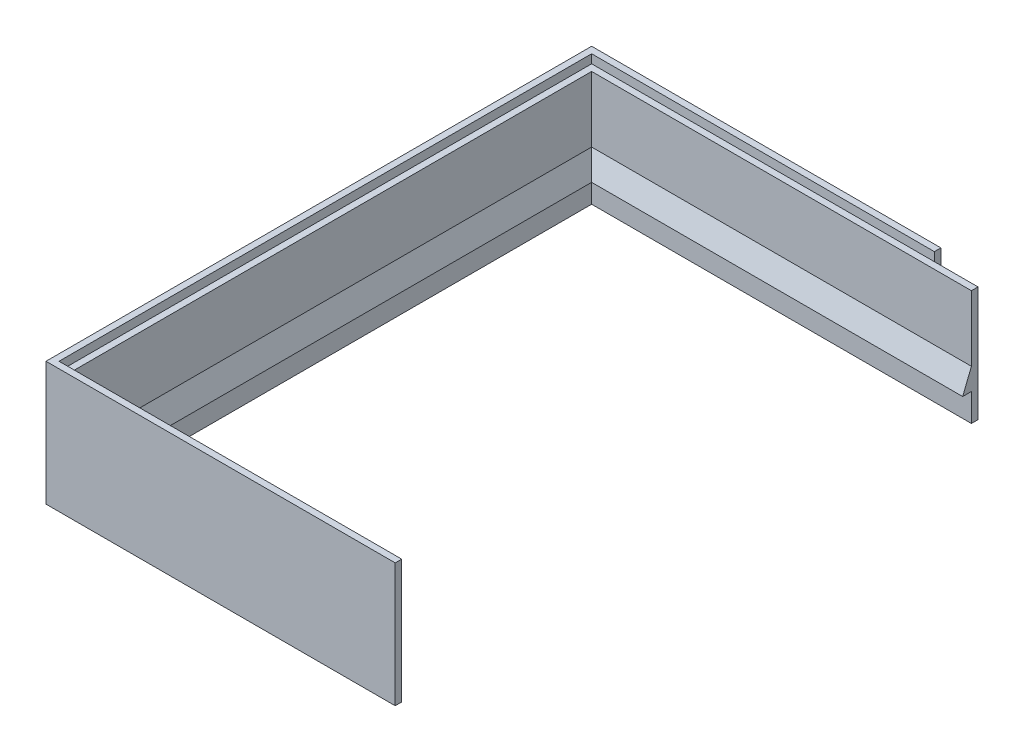
ISO-10303-21;
HEADER;
FILE_DESCRIPTION(('STEP AP214'),'2;1');
FILE_NAME('part.step','',(''),(''),'','','');
FILE_SCHEMA(('AUTOMOTIVE_DESIGN { 1 0 10303 214 1 1 1 1 }'));
ENDSEC;
DATA;
#1=APPLICATION_CONTEXT('core data for automotive mechanical design processes');
#2=APPLICATION_PROTOCOL_DEFINITION('international standard','automotive_design',2000,#1);
#3=PRODUCT_CONTEXT('',#1,'mechanical');
#4=PRODUCT('Part','Part','',(#3));
#5=PRODUCT_RELATED_PRODUCT_CATEGORY('part','',(#4));
#6=PRODUCT_DEFINITION_FORMATION('','',#4);
#7=PRODUCT_DEFINITION_CONTEXT('part definition',#1,'design');
#8=PRODUCT_DEFINITION('design','',#6,#7);
#9=PRODUCT_DEFINITION_SHAPE('','',#8);
#10=(LENGTH_UNIT() NAMED_UNIT(*) SI_UNIT(.MILLI.,.METRE.));
#11=(NAMED_UNIT(*) PLANE_ANGLE_UNIT() SI_UNIT($,.RADIAN.));
#12=(NAMED_UNIT(*) SI_UNIT($,.STERADIAN.) SOLID_ANGLE_UNIT());
#13=UNCERTAINTY_MEASURE_WITH_UNIT(LENGTH_MEASURE(1.E-05),#10,'distance_accuracy_value','');
#14=(GEOMETRIC_REPRESENTATION_CONTEXT(3) GLOBAL_UNCERTAINTY_ASSIGNED_CONTEXT((#13)) GLOBAL_UNIT_ASSIGNED_CONTEXT((#10,
#11,#12)) REPRESENTATION_CONTEXT('',''));
#15=CARTESIAN_POINT('',(0.,0.,0.));
#16=DIRECTION('',(0.,0.,1.));
#17=DIRECTION('',(1.,0.,0.));
#18=AXIS2_PLACEMENT_3D('',#15,#16,#17);
#19=CARTESIAN_POINT('',(0.,22.,-88.51));
#20=DIRECTION('',(-1.,0.,0.));
#21=DIRECTION('',(0.,0.,1.));
#22=AXIS2_PLACEMENT_3D('',#19,#20,#21);
#23=PLANE('',#22);
#24=DIRECTION('',(0.,0.,1.));
#25=VECTOR('',#24,1.);
#26=CARTESIAN_POINT('',(0.,-6.35,0.));
#27=LINE('',#26,#25);
#28=CARTESIAN_POINT('',(0.,-6.35,-90.));
#29=VERTEX_POINT('',#28);
#30=CARTESIAN_POINT('',(0.,-6.35,-88.51));
#31=VERTEX_POINT('',#30);
#32=EDGE_CURVE('E301',#29,#31,#27,.T.);
#33=ORIENTED_EDGE('',*,*,#32,.F.);
#34=DIRECTION('',(0.,-1.,0.));
#35=VECTOR('',#34,1.);
#36=CARTESIAN_POINT('',(0.,-6.35,-90.));
#37=LINE('',#36,#35);
#38=CARTESIAN_POINT('',(0.,22.,-90.));
#39=VERTEX_POINT('',#38);
#40=EDGE_CURVE('E297',#39,#29,#37,.T.);
#41=ORIENTED_EDGE('',*,*,#40,.F.);
#42=DIRECTION('',(0.,0.,1.));
#43=VECTOR('',#42,1.);
#44=CARTESIAN_POINT('',(0.,22.,0.));
#45=LINE('',#44,#43);
#46=CARTESIAN_POINT('',(0.,22.,-88.51));
#47=VERTEX_POINT('',#46);
#48=EDGE_CURVE('E325',#39,#47,#45,.T.);
#49=ORIENTED_EDGE('',*,*,#48,.T.);
#50=DIRECTION('',(0.,-1.,0.));
#51=VECTOR('',#50,1.);
#52=CARTESIAN_POINT('',(0.,22.,-88.51));
#53=LINE('',#52,#51);
#54=CARTESIAN_POINT('',(0.,20.,-88.51));
#55=VERTEX_POINT('',#54);
#56=EDGE_CURVE('E323',#47,#55,#53,.T.);
#57=ORIENTED_EDGE('',*,*,#56,.T.);
#58=DIRECTION('',(0.,-1.,0.));
#59=VECTOR('',#58,1.);
#60=CARTESIAN_POINT('',(0.,22.,-88.51));
#61=LINE('',#60,#59);
#62=EDGE_CURVE('E11',#55,#31,#61,.T.);
#63=ORIENTED_EDGE('',*,*,#62,.T.);
#64=EDGE_LOOP('',(#33,#41,#49,#57,#63));
#65=FACE_BOUND('',#64,.T.);
#66=ADVANCED_FACE('F38',(#65),#23,.F.);
#67=CARTESIAN_POINT('',(10.,22.,-85.));
#68=DIRECTION('',(-1.,0.,0.));
#69=DIRECTION('',(0.,0.,1.));
#70=AXIS2_PLACEMENT_3D('',#67,#68,#69);
#71=PLANE('',#70);
#72=DIRECTION('',(0.,0.,1.));
#73=VECTOR('',#72,1.);
#74=CARTESIAN_POINT('',(10.,20.,0.));
#75=LINE('',#74,#73);
#76=CARTESIAN_POINT('',(9.99999999999999,20.,-88.51));
#77=VERTEX_POINT('',#76);
#78=CARTESIAN_POINT('',(9.99999999999999,20.,-87.));
#79=VERTEX_POINT('',#78);
#80=EDGE_CURVE('E42',#77,#79,#75,.T.);
#81=ORIENTED_EDGE('',*,*,#80,.T.);
#82=DIRECTION('',(0.,-1.,0.));
#83=VECTOR('',#82,1.);
#84=CARTESIAN_POINT('',(9.99999999999999,20.,-87.));
#85=LINE('',#84,#83);
#86=CARTESIAN_POINT('',(9.99999999999999,4.99999999999998,-87.));
#87=VERTEX_POINT('',#86);
#88=EDGE_CURVE('E344',#79,#87,#85,.T.);
#89=ORIENTED_EDGE('',*,*,#88,.T.);
#90=DIRECTION('',(0.,-0.928476690885259,0.371390676354105));
#91=VECTOR('',#90,1.);
#92=CARTESIAN_POINT('',(10.,0.,-85.));
#93=LINE('',#92,#91);
#94=CARTESIAN_POINT('',(9.99999999999999,0.,-85.));
#95=VERTEX_POINT('',#94);
#96=EDGE_CURVE('E298',#95,#87,#93,.F.);
#97=ORIENTED_EDGE('',*,*,#96,.F.);
#98=DIRECTION('',(0.,0.,-1.));
#99=VECTOR('',#98,1.);
#100=CARTESIAN_POINT('',(10.,0.,0.));
#101=LINE('',#100,#99);
#102=CARTESIAN_POINT('',(9.99999999999999,0.,-87.));
#103=VERTEX_POINT('',#102);
#104=EDGE_CURVE('E55',#95,#103,#101,.T.);
#105=ORIENTED_EDGE('',*,*,#104,.T.);
#106=DIRECTION('',(0.,1.,0.));
#107=VECTOR('',#106,1.);
#108=CARTESIAN_POINT('',(9.99999999999999,0.,-87.));
#109=LINE('',#108,#107);
#110=CARTESIAN_POINT('',(9.99999999999999,-6.35,-87.));
#111=VERTEX_POINT('',#110);
#112=EDGE_CURVE('E293',#111,#103,#109,.T.);
#113=ORIENTED_EDGE('',*,*,#112,.F.);
#114=DIRECTION('',(0.,0.,1.));
#115=VECTOR('',#114,1.);
#116=CARTESIAN_POINT('',(10.,-6.35,0.));
#117=LINE('',#116,#115);
#118=CARTESIAN_POINT('',(10.,-6.35,-88.51));
#119=VERTEX_POINT('',#118);
#120=EDGE_CURVE('E308',#119,#111,#117,.T.);
#121=ORIENTED_EDGE('',*,*,#120,.F.);
#122=DIRECTION('',(0.,-1.,0.));
#123=VECTOR('',#122,1.);
#124=CARTESIAN_POINT('',(10.,22.,-88.51));
#125=LINE('',#124,#123);
#126=EDGE_CURVE('E47',#77,#119,#125,.T.);
#127=ORIENTED_EDGE('',*,*,#126,.F.);
#128=EDGE_LOOP('',(#81,#89,#97,#105,#113,#121,#127));
#129=FACE_BOUND('',#128,.T.);
#130=ADVANCED_FACE('F352',(#129),#71,.F.);
#131=CARTESIAN_POINT('',(10.,22.,-88.51));
#132=DIRECTION('',(0.,0.,1.));
#133=DIRECTION('',(1.,0.,0.));
#134=AXIS2_PLACEMENT_3D('',#131,#132,#133);
#135=PLANE('',#134);
#136=ORIENTED_EDGE('',*,*,#126,.T.);
#137=DIRECTION('',(1.,0.,0.));
#138=VECTOR('',#137,1.);
#139=CARTESIAN_POINT('',(-1.22832299886966E-13,-6.35,-88.51));
#140=LINE('',#139,#138);
#141=EDGE_CURVE('E304',#31,#119,#140,.T.);
#142=ORIENTED_EDGE('',*,*,#141,.F.);
#143=ORIENTED_EDGE('',*,*,#62,.F.);
#144=DIRECTION('',(-1.,0.,0.));
#145=VECTOR('',#144,1.);
#146=CARTESIAN_POINT('',(78.51,20.,-88.51));
#147=LINE('',#146,#145);
#148=EDGE_CURVE('E229',#77,#55,#147,.T.);
#149=ORIENTED_EDGE('',*,*,#148,.F.);
#150=EDGE_LOOP('',(#136,#142,#143,#149));
#151=FACE_BOUND('',#150,.T.);
#152=ADVANCED_FACE('F386',(#151),#135,.F.);
#153=CARTESIAN_POINT('',(0.,22.,33.51));
#154=DIRECTION('',(-1.,0.,0.));
#155=DIRECTION('',(0.,0.,1.));
#156=AXIS2_PLACEMENT_3D('',#153,#154,#155);
#157=PLANE('',#156);
#158=DIRECTION('',(0.,0.,1.));
#159=VECTOR('',#158,1.);
#160=CARTESIAN_POINT('',(0.,-6.35,0.));
#161=LINE('',#160,#159);
#162=CARTESIAN_POINT('',(0.,-6.35,33.51));
#163=VERTEX_POINT('',#162);
#164=CARTESIAN_POINT('',(0.,-6.35,35.));
#165=VERTEX_POINT('',#164);
#166=EDGE_CURVE('E318',#163,#165,#161,.T.);
#167=ORIENTED_EDGE('',*,*,#166,.F.);
#168=DIRECTION('',(0.,-1.,0.));
#169=VECTOR('',#168,1.);
#170=CARTESIAN_POINT('',(0.,22.,33.51));
#171=LINE('',#170,#169);
#172=CARTESIAN_POINT('',(0.,22.,33.51));
#173=VERTEX_POINT('',#172);
#174=EDGE_CURVE('E322',#173,#163,#171,.T.);
#175=ORIENTED_EDGE('',*,*,#174,.F.);
#176=DIRECTION('',(0.,0.,1.));
#177=VECTOR('',#176,1.);
#178=CARTESIAN_POINT('',(0.,22.,0.));
#179=LINE('',#178,#177);
#180=CARTESIAN_POINT('',(0.,22.,35.));
#181=VERTEX_POINT('',#180);
#182=EDGE_CURVE('E329',#173,#181,#179,.T.);
#183=ORIENTED_EDGE('',*,*,#182,.T.);
#184=DIRECTION('',(0.,1.,0.));
#185=VECTOR('',#184,1.);
#186=CARTESIAN_POINT('',(0.,-6.35,35.));
#187=LINE('',#186,#185);
#188=EDGE_CURVE('E295',#165,#181,#187,.T.);
#189=ORIENTED_EDGE('',*,*,#188,.F.);
#190=EDGE_LOOP('',(#167,#175,#183,#189));
#191=FACE_BOUND('',#190,.T.);
#192=ADVANCED_FACE('F40',(#191),#157,.F.);
#193=CARTESIAN_POINT('',(-10.,22.,30.));
#194=DIRECTION('',(-1.,0.,0.));
#195=DIRECTION('',(0.,0.,1.));
#196=AXIS2_PLACEMENT_3D('',#193,#194,#195);
#197=PLANE('',#196);
#198=DIRECTION('',(0.,0.,1.));
#199=VECTOR('',#198,1.);
#200=CARTESIAN_POINT('',(-10.,20.,0.));
#201=LINE('',#200,#199);
#202=CARTESIAN_POINT('',(-9.99999999999999,20.,32.));
#203=VERTEX_POINT('',#202);
#204=CARTESIAN_POINT('',(-9.99999999999999,20.,33.51));
#205=VERTEX_POINT('',#204);
#206=EDGE_CURVE('E340',#203,#205,#201,.T.);
#207=ORIENTED_EDGE('',*,*,#206,.T.);
#208=DIRECTION('',(0.,-1.,0.));
#209=VECTOR('',#208,1.);
#210=CARTESIAN_POINT('',(-9.99999999999999,22.,33.51));
#211=LINE('',#210,#209);
#212=CARTESIAN_POINT('',(-9.99999999999999,-6.35,33.51));
#213=VERTEX_POINT('',#212);
#214=EDGE_CURVE('E336',#205,#213,#211,.T.);
#215=ORIENTED_EDGE('',*,*,#214,.T.);
#216=DIRECTION('',(0.,0.,1.));
#217=VECTOR('',#216,1.);
#218=CARTESIAN_POINT('',(-10.,-6.35,0.));
#219=LINE('',#218,#217);
#220=CARTESIAN_POINT('',(-9.99999999999999,-6.35,32.));
#221=VERTEX_POINT('',#220);
#222=EDGE_CURVE('E311',#221,#213,#219,.T.);
#223=ORIENTED_EDGE('',*,*,#222,.F.);
#224=DIRECTION('',(0.,-1.,0.));
#225=VECTOR('',#224,1.);
#226=CARTESIAN_POINT('',(-9.99999999999999,0.,32.));
#227=LINE('',#226,#225);
#228=CARTESIAN_POINT('',(-9.99999999999999,0.,32.));
#229=VERTEX_POINT('',#228);
#230=EDGE_CURVE('E287',#229,#221,#227,.T.);
#231=ORIENTED_EDGE('',*,*,#230,.F.);
#232=DIRECTION('',(0.,0.,-1.));
#233=VECTOR('',#232,1.);
#234=CARTESIAN_POINT('',(-10.,0.,0.));
#235=LINE('',#234,#233);
#236=CARTESIAN_POINT('',(-9.99999999999999,0.,30.));
#237=VERTEX_POINT('',#236);
#238=EDGE_CURVE('E188',#229,#237,#235,.T.);
#239=ORIENTED_EDGE('',*,*,#238,.T.);
#240=DIRECTION('',(0.,0.928476690885259,0.371390676354105));
#241=VECTOR('',#240,1.);
#242=CARTESIAN_POINT('',(-10.,0.,30.));
#243=LINE('',#242,#241);
#244=CARTESIAN_POINT('',(-9.99999999999999,4.99999999999998,32.));
#245=VERTEX_POINT('',#244);
#246=EDGE_CURVE('E63',#245,#237,#243,.F.);
#247=ORIENTED_EDGE('',*,*,#246,.F.);
#248=DIRECTION('',(0.,1.,0.));
#249=VECTOR('',#248,1.);
#250=CARTESIAN_POINT('',(-9.99999999999999,20.,32.));
#251=LINE('',#250,#249);
#252=EDGE_CURVE('E332',#245,#203,#251,.T.);
#253=ORIENTED_EDGE('',*,*,#252,.T.);
#254=EDGE_LOOP('',(#207,#215,#223,#231,#239,#247,#253));
#255=FACE_BOUND('',#254,.T.);
#256=ADVANCED_FACE('F429',(#255),#197,.F.);
#257=CARTESIAN_POINT('',(-77.,20.,-87.));
#258=DIRECTION('',(1.,0.,0.));
#259=DIRECTION('',(0.,0.,-1.));
#260=AXIS2_PLACEMENT_3D('',#257,#258,#259);
#261=PLANE('',#260);
#262=DIRECTION('',(0.,-1.,0.));
#263=VECTOR('',#262,1.);
#264=CARTESIAN_POINT('',(-77.,20.,32.));
#265=LINE('',#264,#263);
#266=CARTESIAN_POINT('',(-77.,20.,32.));
#267=VERTEX_POINT('',#266);
#268=CARTESIAN_POINT('',(-77.,4.99999999999998,32.));
#269=VERTEX_POINT('',#268);
#270=EDGE_CURVE('E255',#267,#269,#265,.T.);
#271=ORIENTED_EDGE('',*,*,#270,.T.);
#272=DIRECTION('',(0.,0.,-1.));
#273=VECTOR('',#272,1.);
#274=CARTESIAN_POINT('',(-77.,4.99999999999998,-87.));
#275=LINE('',#274,#273);
#276=CARTESIAN_POINT('',(-77.,4.99999999999998,-87.));
#277=VERTEX_POINT('',#276);
#278=EDGE_CURVE('E282',#269,#277,#275,.T.);
#279=ORIENTED_EDGE('',*,*,#278,.T.);
#280=DIRECTION('',(0.,-1.,0.));
#281=VECTOR('',#280,1.);
#282=CARTESIAN_POINT('',(-77.,20.,-87.));
#283=LINE('',#282,#281);
#284=CARTESIAN_POINT('',(-77.,20.,-87.));
#285=VERTEX_POINT('',#284);
#286=EDGE_CURVE('E258',#285,#277,#283,.T.);
#287=ORIENTED_EDGE('',*,*,#286,.F.);
#288=DIRECTION('',(0.,0.,1.));
#289=VECTOR('',#288,1.);
#290=CARTESIAN_POINT('',(-77.,20.,-87.));
#291=LINE('',#290,#289);
#292=EDGE_CURVE('E250',#285,#267,#291,.T.);
#293=ORIENTED_EDGE('',*,*,#292,.T.);
#294=EDGE_LOOP('',(#271,#279,#287,#293));
#295=FACE_BOUND('',#294,.T.);
#296=ADVANCED_FACE('F365',(#295),#261,.T.);
#297=CARTESIAN_POINT('',(78.51,22.,-88.51));
#298=DIRECTION('',(0.,0.,1.));
#299=DIRECTION('',(1.,0.,0.));
#300=AXIS2_PLACEMENT_3D('',#297,#298,#299);
#301=PLANE('',#300);
#302=ORIENTED_EDGE('',*,*,#56,.F.);
#303=DIRECTION('',(-1.,0.,0.));
#304=VECTOR('',#303,1.);
#305=CARTESIAN_POINT('',(78.51,22.,-88.51));
#306=LINE('',#305,#304);
#307=CARTESIAN_POINT('',(-78.51,22.,-88.51));
#308=VERTEX_POINT('',#307);
#309=EDGE_CURVE('E216',#47,#308,#306,.T.);
#310=ORIENTED_EDGE('',*,*,#309,.T.);
#311=DIRECTION('',(0.,-1.,0.));
#312=VECTOR('',#311,1.);
#313=CARTESIAN_POINT('',(-78.51,22.,-88.51));
#314=LINE('',#313,#312);
#315=CARTESIAN_POINT('',(-78.51,20.,-88.51));
#316=VERTEX_POINT('',#315);
#317=EDGE_CURVE('E237',#308,#316,#314,.T.);
#318=ORIENTED_EDGE('',*,*,#317,.T.);
#319=EDGE_CURVE('E227',#55,#316,#147,.T.);
#320=ORIENTED_EDGE('',*,*,#319,.F.);
#321=EDGE_LOOP('',(#302,#310,#318,#320));
#322=FACE_BOUND('',#321,.T.);
#323=ADVANCED_FACE('F391',(#322),#301,.T.);
#324=CARTESIAN_POINT('',(-80.,-6.35,-90.));
#325=DIRECTION('',(1.,0.,0.));
#326=DIRECTION('',(0.,0.,-1.));
#327=AXIS2_PLACEMENT_3D('',#324,#325,#326);
#328=PLANE('',#327);
#329=DIRECTION('',(0.,1.,0.));
#330=VECTOR('',#329,1.);
#331=CARTESIAN_POINT('',(-80.,-6.35,35.));
#332=LINE('',#331,#330);
#333=CARTESIAN_POINT('',(-80.,-6.35,35.));
#334=VERTEX_POINT('',#333);
#335=CARTESIAN_POINT('',(-80.,22.,35.));
#336=VERTEX_POINT('',#335);
#337=EDGE_CURVE('E269',#334,#336,#332,.T.);
#338=ORIENTED_EDGE('',*,*,#337,.T.);
#339=DIRECTION('',(0.,0.,1.));
#340=VECTOR('',#339,1.);
#341=CARTESIAN_POINT('',(-80.,22.,-90.));
#342=LINE('',#341,#340);
#343=CARTESIAN_POINT('',(-80.,22.,-90.));
#344=VERTEX_POINT('',#343);
#345=EDGE_CURVE('E240',#344,#336,#342,.T.);
#346=ORIENTED_EDGE('',*,*,#345,.F.);
#347=DIRECTION('',(0.,1.,0.));
#348=VECTOR('',#347,1.);
#349=CARTESIAN_POINT('',(-80.,-6.35,-90.));
#350=LINE('',#349,#348);
#351=CARTESIAN_POINT('',(-80.,-6.35,-90.));
#352=VERTEX_POINT('',#351);
#353=EDGE_CURVE('E271',#352,#344,#350,.T.);
#354=ORIENTED_EDGE('',*,*,#353,.F.);
#355=DIRECTION('',(0.,0.,-1.));
#356=VECTOR('',#355,1.);
#357=CARTESIAN_POINT('',(-80.,-6.35,-90.));
#358=LINE('',#357,#356);
#359=EDGE_CURVE('E261',#334,#352,#358,.T.);
#360=ORIENTED_EDGE('',*,*,#359,.F.);
#361=EDGE_LOOP('',(#338,#346,#354,#360));
#362=FACE_BOUND('',#361,.T.);
#363=ADVANCED_FACE('F453',(#362),#328,.F.);
#364=CARTESIAN_POINT('',(0.,22.,0.));
#365=DIRECTION('',(0.,1.,0.));
#366=DIRECTION('',(0.,0.,1.));
#367=AXIS2_PLACEMENT_3D('',#364,#365,#366);
#368=PLANE('',#367);
#369=ORIENTED_EDGE('',*,*,#182,.F.);
#370=DIRECTION('',(1.,0.,0.));
#371=VECTOR('',#370,1.);
#372=CARTESIAN_POINT('',(-78.51,22.,33.51));
#373=LINE('',#372,#371);
#374=CARTESIAN_POINT('',(-78.51,22.,33.51));
#375=VERTEX_POINT('',#374);
#376=EDGE_CURVE('E222',#375,#173,#373,.T.);
#377=ORIENTED_EDGE('',*,*,#376,.F.);
#378=DIRECTION('',(0.,0.,1.));
#379=VECTOR('',#378,1.);
#380=CARTESIAN_POINT('',(-78.51,22.,-88.51));
#381=LINE('',#380,#379);
#382=EDGE_CURVE('E218',#308,#375,#381,.T.);
#383=ORIENTED_EDGE('',*,*,#382,.F.);
#384=ORIENTED_EDGE('',*,*,#309,.F.);
#385=ORIENTED_EDGE('',*,*,#48,.F.);
#386=DIRECTION('',(-1.,0.,0.));
#387=VECTOR('',#386,1.);
#388=CARTESIAN_POINT('',(80.,22.,-90.));
#389=LINE('',#388,#387);
#390=EDGE_CURVE('E246',#39,#344,#389,.T.);
#391=ORIENTED_EDGE('',*,*,#390,.T.);
#392=ORIENTED_EDGE('',*,*,#345,.T.);
#393=DIRECTION('',(1.,0.,0.));
#394=VECTOR('',#393,1.);
#395=CARTESIAN_POINT('',(-80.,22.,35.));
#396=LINE('',#395,#394);
#397=EDGE_CURVE('E243',#336,#181,#396,.T.);
#398=ORIENTED_EDGE('',*,*,#397,.T.);
#399=EDGE_LOOP('',(#369,#377,#383,#384,#385,#391,#392,#398));
#400=FACE_BOUND('',#399,.T.);
#401=ADVANCED_FACE('F454',(#400),#368,.T.);
#402=CARTESIAN_POINT('',(-77.,20.,32.));
#403=DIRECTION('',(0.,0.,-1.));
#404=DIRECTION('',(-1.,0.,0.));
#405=AXIS2_PLACEMENT_3D('',#402,#403,#404);
#406=PLANE('',#405);
#407=ORIENTED_EDGE('',*,*,#252,.F.);
#408=DIRECTION('',(-1.,0.,0.));
#409=VECTOR('',#408,1.);
#410=CARTESIAN_POINT('',(-77.,4.99999999999998,32.));
#411=LINE('',#410,#409);
#412=EDGE_CURVE('E280',#245,#269,#411,.T.);
#413=ORIENTED_EDGE('',*,*,#412,.T.);
#414=ORIENTED_EDGE('',*,*,#270,.F.);
#415=DIRECTION('',(1.,0.,0.));
#416=VECTOR('',#415,1.);
#417=CARTESIAN_POINT('',(-77.,20.,32.));
#418=LINE('',#417,#416);
#419=EDGE_CURVE('E252',#267,#203,#418,.T.);
#420=ORIENTED_EDGE('',*,*,#419,.T.);
#421=EDGE_LOOP('',(#407,#413,#414,#420));
#422=FACE_BOUND('',#421,.T.);
#423=ADVANCED_FACE('F404',(#422),#406,.T.);
#424=CARTESIAN_POINT('',(-77.,20.,-87.));
#425=DIRECTION('',(0.,0.,1.));
#426=DIRECTION('',(1.,0.,0.));
#427=AXIS2_PLACEMENT_3D('',#424,#425,#426);
#428=PLANE('',#427);
#429=ORIENTED_EDGE('',*,*,#88,.F.);
#430=DIRECTION('',(-1.,0.,0.));
#431=VECTOR('',#430,1.);
#432=CARTESIAN_POINT('',(-77.,20.,-87.));
#433=LINE('',#432,#431);
#434=EDGE_CURVE('E248',#79,#285,#433,.T.);
#435=ORIENTED_EDGE('',*,*,#434,.T.);
#436=ORIENTED_EDGE('',*,*,#286,.T.);
#437=DIRECTION('',(1.,0.,0.));
#438=VECTOR('',#437,1.);
#439=CARTESIAN_POINT('',(77.,4.99999999999998,-87.));
#440=LINE('',#439,#438);
#441=EDGE_CURVE('E284',#277,#87,#440,.T.);
#442=ORIENTED_EDGE('',*,*,#441,.T.);
#443=EDGE_LOOP('',(#429,#435,#436,#442));
#444=FACE_BOUND('',#443,.T.);
#445=ADVANCED_FACE('F362',(#444),#428,.T.);
#446=CARTESIAN_POINT('',(0.,0.,30.));
#447=DIRECTION('',(0.,0.371390676354105,-0.928476690885259));
#448=DIRECTION('',(-1.,0.,0.));
#449=AXIS2_PLACEMENT_3D('',#446,#447,#448);
#450=PLANE('',#449);
#451=ORIENTED_EDGE('',*,*,#412,.F.);
#452=ORIENTED_EDGE('',*,*,#246,.T.);
#453=DIRECTION('',(1.,0.,0.));
#454=VECTOR('',#453,1.);
#455=CARTESIAN_POINT('',(77.,0.,30.));
#456=LINE('',#455,#454);
#457=CARTESIAN_POINT('',(-75.,0.,30.));
#458=VERTEX_POINT('',#457);
#459=EDGE_CURVE('E278',#458,#237,#456,.T.);
#460=ORIENTED_EDGE('',*,*,#459,.F.);
#461=DIRECTION('',(0.348155311911397,-0.870388279778488,-0.348155311911397));
#462=VECTOR('',#461,1.);
#463=CARTESIAN_POINT('',(-65.9090909090908,-22.7272727272728,20.9090909090908));
#464=LINE('',#463,#462);
#465=EDGE_CURVE('E214',#458,#269,#464,.F.);
#466=ORIENTED_EDGE('',*,*,#465,.T.);
#467=EDGE_LOOP('',(#451,#452,#460,#466));
#468=FACE_BOUND('',#467,.T.);
#469=ADVANCED_FACE('F405',(#468),#450,.T.);
#470=CARTESIAN_POINT('',(-75.,0.,0.));
#471=DIRECTION('',(0.928476690885259,0.371390676354105,0.));
#472=DIRECTION('',(0.,0.,-1.));
#473=AXIS2_PLACEMENT_3D('',#470,#471,#472);
#474=PLANE('',#473);
#475=DIRECTION('',(0.348155311911397,-0.870388279778488,0.348155311911397));
#476=VECTOR('',#475,1.);
#477=CARTESIAN_POINT('',(-64.6969696969696,-25.7575757575758,-74.6969696969696));
#478=LINE('',#477,#476);
#479=CARTESIAN_POINT('',(-75.,0.,-85.));
#480=VERTEX_POINT('',#479);
#481=EDGE_CURVE('E230',#480,#277,#478,.F.);
#482=ORIENTED_EDGE('',*,*,#481,.T.);
#483=ORIENTED_EDGE('',*,*,#278,.F.);
#484=ORIENTED_EDGE('',*,*,#465,.F.);
#485=DIRECTION('',(0.,0.,1.));
#486=VECTOR('',#485,1.);
#487=CARTESIAN_POINT('',(-75.,0.,32.));
#488=LINE('',#487,#486);
#489=EDGE_CURVE('E276',#480,#458,#488,.T.);
#490=ORIENTED_EDGE('',*,*,#489,.F.);
#491=EDGE_LOOP('',(#482,#483,#484,#490));
#492=FACE_BOUND('',#491,.T.);
#493=ADVANCED_FACE('F370',(#492),#474,.T.);
#494=CARTESIAN_POINT('',(0.,0.,-85.));
#495=DIRECTION('',(0.,0.371390676354105,0.928476690885259));
#496=DIRECTION('',(1.,0.,0.));
#497=AXIS2_PLACEMENT_3D('',#494,#495,#496);
#498=PLANE('',#497);
#499=DIRECTION('',(-1.,0.,0.));
#500=VECTOR('',#499,1.);
#501=CARTESIAN_POINT('',(-77.,0.,-85.));
#502=LINE('',#501,#500);
#503=EDGE_CURVE('E274',#95,#480,#502,.T.);
#504=ORIENTED_EDGE('',*,*,#503,.F.);
#505=ORIENTED_EDGE('',*,*,#96,.T.);
#506=ORIENTED_EDGE('',*,*,#441,.F.);
#507=ORIENTED_EDGE('',*,*,#481,.F.);
#508=EDGE_LOOP('',(#504,#505,#506,#507));
#509=FACE_BOUND('',#508,.T.);
#510=ADVANCED_FACE('F375',(#509),#498,.T.);
#511=CARTESIAN_POINT('',(-77.,0.,32.));
#512=DIRECTION('',(-1.,0.,0.));
#513=DIRECTION('',(0.,0.,1.));
#514=AXIS2_PLACEMENT_3D('',#511,#512,#513);
#515=PLANE('',#514);
#516=DIRECTION('',(0.,0.,-1.));
#517=VECTOR('',#516,1.);
#518=CARTESIAN_POINT('',(-77.,-6.35,32.));
#519=LINE('',#518,#517);
#520=CARTESIAN_POINT('',(-77.,-6.35,32.));
#521=VERTEX_POINT('',#520);
#522=CARTESIAN_POINT('',(-77.,-6.35,-87.));
#523=VERTEX_POINT('',#522);
#524=EDGE_CURVE('E210',#521,#523,#519,.T.);
#525=ORIENTED_EDGE('',*,*,#524,.T.);
#526=DIRECTION('',(0.,-1.,0.));
#527=VECTOR('',#526,1.);
#528=CARTESIAN_POINT('',(-77.,0.,-87.));
#529=LINE('',#528,#527);
#530=CARTESIAN_POINT('',(-77.,0.,-87.));
#531=VERTEX_POINT('',#530);
#532=EDGE_CURVE('E201',#531,#523,#529,.T.);
#533=ORIENTED_EDGE('',*,*,#532,.F.);
#534=DIRECTION('',(0.,0.,-1.));
#535=VECTOR('',#534,1.);
#536=CARTESIAN_POINT('',(-77.,0.,32.));
#537=LINE('',#536,#535);
#538=CARTESIAN_POINT('',(-77.,0.,32.));
#539=VERTEX_POINT('',#538);
#540=EDGE_CURVE('E186',#539,#531,#537,.T.);
#541=ORIENTED_EDGE('',*,*,#540,.F.);
#542=DIRECTION('',(0.,-1.,0.));
#543=VECTOR('',#542,1.);
#544=CARTESIAN_POINT('',(-77.,0.,32.));
#545=LINE('',#544,#543);
#546=EDGE_CURVE('E194',#539,#521,#545,.T.);
#547=ORIENTED_EDGE('',*,*,#546,.T.);
#548=EDGE_LOOP('',(#525,#533,#541,#547));
#549=FACE_BOUND('',#548,.T.);
#550=ADVANCED_FACE('F204',(#549),#515,.F.);
#551=CARTESIAN_POINT('',(0.,-6.35,0.));
#552=DIRECTION('',(0.,1.,0.));
#553=DIRECTION('',(0.,0.,1.));
#554=AXIS2_PLACEMENT_3D('',#551,#552,#553);
#555=PLANE('',#554);
#556=DIRECTION('',(1.,0.,0.));
#557=VECTOR('',#556,1.);
#558=CARTESIAN_POINT('',(0.,-6.35,33.51));
#559=LINE('',#558,#557);
#560=EDGE_CURVE('E314',#213,#163,#559,.T.);
#561=ORIENTED_EDGE('',*,*,#560,.T.);
#562=ORIENTED_EDGE('',*,*,#166,.T.);
#563=DIRECTION('',(-1.,0.,0.));
#564=VECTOR('',#563,1.);
#565=CARTESIAN_POINT('',(-80.,-6.35,35.));
#566=LINE('',#565,#564);
#567=EDGE_CURVE('E267',#165,#334,#566,.T.);
#568=ORIENTED_EDGE('',*,*,#567,.T.);
#569=ORIENTED_EDGE('',*,*,#359,.T.);
#570=DIRECTION('',(1.,0.,0.));
#571=VECTOR('',#570,1.);
#572=CARTESIAN_POINT('',(-80.,-6.35,-90.));
#573=LINE('',#572,#571);
#574=EDGE_CURVE('E264',#352,#29,#573,.T.);
#575=ORIENTED_EDGE('',*,*,#574,.T.);
#576=ORIENTED_EDGE('',*,*,#32,.T.);
#577=ORIENTED_EDGE('',*,*,#141,.T.);
#578=ORIENTED_EDGE('',*,*,#120,.T.);
#579=DIRECTION('',(1.,0.,0.));
#580=VECTOR('',#579,1.);
#581=CARTESIAN_POINT('',(-77.,-6.35,-87.));
#582=LINE('',#581,#580);
#583=EDGE_CURVE('E191',#523,#111,#582,.T.);
#584=ORIENTED_EDGE('',*,*,#583,.F.);
#585=ORIENTED_EDGE('',*,*,#524,.F.);
#586=DIRECTION('',(-1.,0.,0.));
#587=VECTOR('',#586,1.);
#588=CARTESIAN_POINT('',(77.,-6.35,32.));
#589=LINE('',#588,#587);
#590=EDGE_CURVE('E197',#221,#521,#589,.T.);
#591=ORIENTED_EDGE('',*,*,#590,.F.);
#592=ORIENTED_EDGE('',*,*,#222,.T.);
#593=EDGE_LOOP('',(#561,#562,#568,#569,#575,#576,#577,#578,#584,#585,#591,#592));
#594=FACE_BOUND('',#593,.T.);
#595=ADVANCED_FACE('F381',(#594),#555,.F.);
#596=CARTESIAN_POINT('',(0.,0.,0.));
#597=DIRECTION('',(0.,-1.,0.));
#598=DIRECTION('',(0.,0.,-1.));
#599=AXIS2_PLACEMENT_3D('',#596,#597,#598);
#600=PLANE('',#599);
#601=ORIENTED_EDGE('',*,*,#238,.F.);
#602=DIRECTION('',(-1.,0.,0.));
#603=VECTOR('',#602,1.);
#604=CARTESIAN_POINT('',(77.,0.,32.));
#605=LINE('',#604,#603);
#606=EDGE_CURVE('E182',#229,#539,#605,.T.);
#607=ORIENTED_EDGE('',*,*,#606,.T.);
#608=ORIENTED_EDGE('',*,*,#540,.T.);
#609=DIRECTION('',(1.,0.,0.));
#610=VECTOR('',#609,1.);
#611=CARTESIAN_POINT('',(-77.,0.,-87.));
#612=LINE('',#611,#610);
#613=EDGE_CURVE('E202',#531,#103,#612,.T.);
#614=ORIENTED_EDGE('',*,*,#613,.T.);
#615=ORIENTED_EDGE('',*,*,#104,.F.);
#616=ORIENTED_EDGE('',*,*,#503,.T.);
#617=ORIENTED_EDGE('',*,*,#489,.T.);
#618=ORIENTED_EDGE('',*,*,#459,.T.);
#619=EDGE_LOOP('',(#601,#607,#608,#614,#615,#616,#617,#618));
#620=FACE_BOUND('',#619,.T.);
#621=ADVANCED_FACE('F184',(#620),#600,.T.);
#622=CARTESIAN_POINT('',(77.,0.,32.));
#623=DIRECTION('',(0.,0.,1.));
#624=DIRECTION('',(1.,0.,0.));
#625=AXIS2_PLACEMENT_3D('',#622,#623,#624);
#626=PLANE('',#625);
#627=ORIENTED_EDGE('',*,*,#606,.F.);
#628=ORIENTED_EDGE('',*,*,#230,.T.);
#629=ORIENTED_EDGE('',*,*,#590,.T.);
#630=ORIENTED_EDGE('',*,*,#546,.F.);
#631=EDGE_LOOP('',(#627,#628,#629,#630));
#632=FACE_BOUND('',#631,.T.);
#633=ADVANCED_FACE('F195',(#632),#626,.F.);
#634=CARTESIAN_POINT('',(-77.,0.,-87.));
#635=DIRECTION('',(0.,0.,-1.));
#636=DIRECTION('',(-1.,0.,0.));
#637=AXIS2_PLACEMENT_3D('',#634,#635,#636);
#638=PLANE('',#637);
#639=ORIENTED_EDGE('',*,*,#583,.T.);
#640=ORIENTED_EDGE('',*,*,#112,.T.);
#641=ORIENTED_EDGE('',*,*,#613,.F.);
#642=ORIENTED_EDGE('',*,*,#532,.T.);
#643=EDGE_LOOP('',(#639,#640,#641,#642));
#644=FACE_BOUND('',#643,.T.);
#645=ADVANCED_FACE('F378',(#644),#638,.F.);
#646=CARTESIAN_POINT('',(-80.,-6.35,35.));
#647=DIRECTION('',(0.,0.,-1.));
#648=DIRECTION('',(-1.,0.,0.));
#649=AXIS2_PLACEMENT_3D('',#646,#647,#648);
#650=PLANE('',#649);
#651=ORIENTED_EDGE('',*,*,#567,.F.);
#652=ORIENTED_EDGE('',*,*,#188,.T.);
#653=ORIENTED_EDGE('',*,*,#397,.F.);
#654=ORIENTED_EDGE('',*,*,#337,.F.);
#655=EDGE_LOOP('',(#651,#652,#653,#654));
#656=FACE_BOUND('',#655,.T.);
#657=ADVANCED_FACE('F462',(#656),#650,.F.);
#658=CARTESIAN_POINT('',(-80.,-6.35,-90.));
#659=DIRECTION('',(0.,0.,1.));
#660=DIRECTION('',(1.,0.,0.));
#661=AXIS2_PLACEMENT_3D('',#658,#659,#660);
#662=PLANE('',#661);
#663=ORIENTED_EDGE('',*,*,#390,.F.);
#664=ORIENTED_EDGE('',*,*,#40,.T.);
#665=ORIENTED_EDGE('',*,*,#574,.F.);
#666=ORIENTED_EDGE('',*,*,#353,.T.);
#667=EDGE_LOOP('',(#663,#664,#665,#666));
#668=FACE_BOUND('',#667,.T.);
#669=ADVANCED_FACE('F450',(#668),#662,.F.);
#670=CARTESIAN_POINT('',(-78.51,22.,-88.51));
#671=DIRECTION('',(1.,0.,0.));
#672=DIRECTION('',(0.,0.,-1.));
#673=AXIS2_PLACEMENT_3D('',#670,#671,#672);
#674=PLANE('',#673);
#675=DIRECTION('',(0.,0.,1.));
#676=VECTOR('',#675,1.);
#677=CARTESIAN_POINT('',(-78.51,20.,-88.51));
#678=LINE('',#677,#676);
#679=CARTESIAN_POINT('',(-78.51,20.,33.51));
#680=VERTEX_POINT('',#679);
#681=EDGE_CURVE('E231',#316,#680,#678,.T.);
#682=ORIENTED_EDGE('',*,*,#681,.F.);
#683=ORIENTED_EDGE('',*,*,#317,.F.);
#684=ORIENTED_EDGE('',*,*,#382,.T.);
#685=DIRECTION('',(0.,-1.,0.));
#686=VECTOR('',#685,1.);
#687=CARTESIAN_POINT('',(-78.51,22.,33.51));
#688=LINE('',#687,#686);
#689=EDGE_CURVE('E226',#375,#680,#688,.T.);
#690=ORIENTED_EDGE('',*,*,#689,.T.);
#691=EDGE_LOOP('',(#682,#683,#684,#690));
#692=FACE_BOUND('',#691,.T.);
#693=ADVANCED_FACE('F395',(#692),#674,.T.);
#694=CARTESIAN_POINT('',(0.,20.,0.));
#695=DIRECTION('',(0.,1.,0.));
#696=DIRECTION('',(0.,0.,1.));
#697=AXIS2_PLACEMENT_3D('',#694,#695,#696);
#698=PLANE('',#697);
#699=ORIENTED_EDGE('',*,*,#206,.F.);
#700=ORIENTED_EDGE('',*,*,#419,.F.);
#701=ORIENTED_EDGE('',*,*,#292,.F.);
#702=ORIENTED_EDGE('',*,*,#434,.F.);
#703=ORIENTED_EDGE('',*,*,#80,.F.);
#704=ORIENTED_EDGE('',*,*,#148,.T.);
#705=ORIENTED_EDGE('',*,*,#319,.T.);
#706=ORIENTED_EDGE('',*,*,#681,.T.);
#707=DIRECTION('',(1.,0.,0.));
#708=VECTOR('',#707,1.);
#709=CARTESIAN_POINT('',(-78.51,20.,33.51));
#710=LINE('',#709,#708);
#711=EDGE_CURVE('E219',#680,#205,#710,.T.);
#712=ORIENTED_EDGE('',*,*,#711,.T.);
#713=EDGE_LOOP('',(#699,#700,#701,#702,#703,#704,#705,#706,#712));
#714=FACE_BOUND('',#713,.T.);
#715=ADVANCED_FACE('F358',(#714),#698,.T.);
#716=CARTESIAN_POINT('',(-78.51,22.,33.51));
#717=DIRECTION('',(0.,0.,-1.));
#718=DIRECTION('',(-1.,0.,0.));
#719=AXIS2_PLACEMENT_3D('',#716,#717,#718);
#720=PLANE('',#719);
#721=ORIENTED_EDGE('',*,*,#376,.T.);
#722=ORIENTED_EDGE('',*,*,#174,.T.);
#723=ORIENTED_EDGE('',*,*,#560,.F.);
#724=ORIENTED_EDGE('',*,*,#214,.F.);
#725=ORIENTED_EDGE('',*,*,#711,.F.);
#726=ORIENTED_EDGE('',*,*,#689,.F.);
#727=EDGE_LOOP('',(#721,#722,#723,#724,#725,#726));
#728=FACE_BOUND('',#727,.T.);
#729=ADVANCED_FACE('F400',(#728),#720,.T.);
#730=CLOSED_SHELL('',(#66,#130,#152,#192,#256,#296,#323,#363,#401,#423,#445,#469,#493,#510,#550,
#595,#621,#633,#645,#657,#669,#693,#715,#729));
#731=MANIFOLD_SOLID_BREP('B2',#730);
#732=ADVANCED_BREP_SHAPE_REPRESENTATION('',(#18,#731),#14);
#733=SHAPE_DEFINITION_REPRESENTATION(#9,#732);
ENDSEC;
END-ISO-10303-21;
